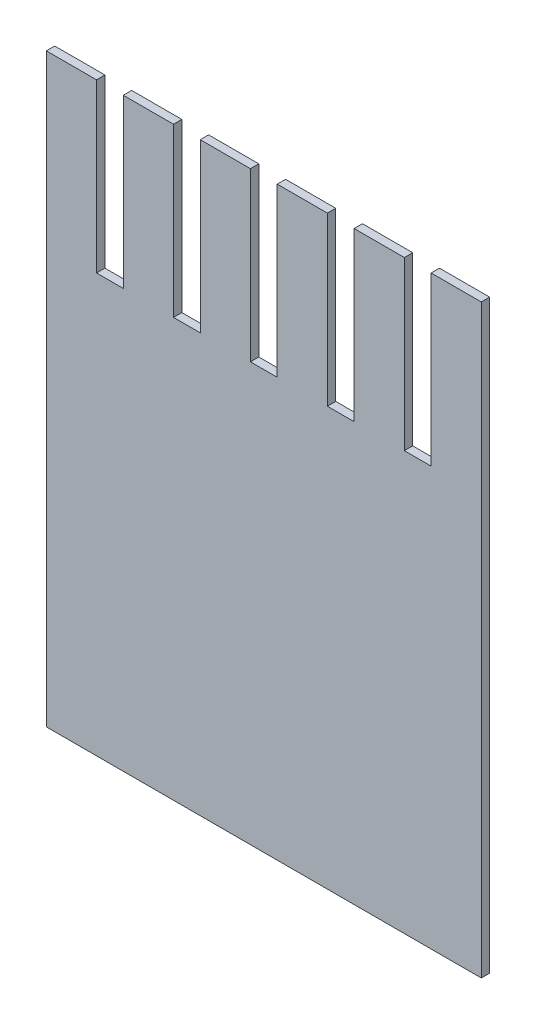
ISO-10303-21;
HEADER;
FILE_DESCRIPTION(('STEP AP214'),'2;1');
FILE_NAME('part.step','',(''),(''),'','','');
FILE_SCHEMA(('AUTOMOTIVE_DESIGN { 1 0 10303 214 1 1 1 1 }'));
ENDSEC;
DATA;
#1=APPLICATION_CONTEXT('core data for automotive mechanical design processes');
#2=APPLICATION_PROTOCOL_DEFINITION('international standard','automotive_design',2000,#1);
#3=PRODUCT_CONTEXT('',#1,'mechanical');
#4=PRODUCT('Part','Part','',(#3));
#5=PRODUCT_RELATED_PRODUCT_CATEGORY('part','',(#4));
#6=PRODUCT_DEFINITION_FORMATION('','',#4);
#7=PRODUCT_DEFINITION_CONTEXT('part definition',#1,'design');
#8=PRODUCT_DEFINITION('design','',#6,#7);
#9=PRODUCT_DEFINITION_SHAPE('','',#8);
#10=(LENGTH_UNIT() NAMED_UNIT(*) SI_UNIT(.MILLI.,.METRE.));
#11=(NAMED_UNIT(*) PLANE_ANGLE_UNIT() SI_UNIT($,.RADIAN.));
#12=(NAMED_UNIT(*) SI_UNIT($,.STERADIAN.) SOLID_ANGLE_UNIT());
#13=UNCERTAINTY_MEASURE_WITH_UNIT(LENGTH_MEASURE(1.E-05),#10,'distance_accuracy_value','');
#14=(GEOMETRIC_REPRESENTATION_CONTEXT(3) GLOBAL_UNCERTAINTY_ASSIGNED_CONTEXT((#13)) GLOBAL_UNIT_ASSIGNED_CONTEXT((#10,
#11,#12)) REPRESENTATION_CONTEXT('',''));
#15=CARTESIAN_POINT('',(0.,0.,0.));
#16=DIRECTION('',(0.,0.,1.));
#17=DIRECTION('',(1.,0.,0.));
#18=AXIS2_PLACEMENT_3D('',#15,#16,#17);
#19=CARTESIAN_POINT('',(0.,0.,0.5));
#20=DIRECTION('',(0.,1.,0.));
#21=DIRECTION('',(0.,0.,1.));
#22=AXIS2_PLACEMENT_3D('',#19,#20,#21);
#23=PLANE('',#22);
#24=DIRECTION('',(1.,0.,0.));
#25=VECTOR('',#24,1.);
#26=CARTESIAN_POINT('',(0.,0.,0.));
#27=LINE('',#26,#25);
#28=CARTESIAN_POINT('',(0.,0.,0.));
#29=VERTEX_POINT('',#28);
#30=CARTESIAN_POINT('',(26.,0.,0.));
#31=VERTEX_POINT('',#30);
#32=EDGE_CURVE('E238',#29,#31,#27,.T.);
#33=ORIENTED_EDGE('',*,*,#32,.T.);
#34=DIRECTION('',(0.,0.,-1.));
#35=VECTOR('',#34,1.);
#36=CARTESIAN_POINT('',(26.,0.,0.5));
#37=LINE('',#36,#35);
#38=CARTESIAN_POINT('',(26.,0.,0.5));
#39=VERTEX_POINT('',#38);
#40=EDGE_CURVE('E11',#39,#31,#37,.T.);
#41=ORIENTED_EDGE('',*,*,#40,.F.);
#42=DIRECTION('',(1.,0.,0.));
#43=VECTOR('',#42,1.);
#44=CARTESIAN_POINT('',(0.,0.,0.5));
#45=LINE('',#44,#43);
#46=CARTESIAN_POINT('',(0.,0.,0.5));
#47=VERTEX_POINT('',#46);
#48=EDGE_CURVE('E318',#47,#39,#45,.T.);
#49=ORIENTED_EDGE('',*,*,#48,.F.);
#50=DIRECTION('',(0.,0.,-1.));
#51=VECTOR('',#50,1.);
#52=CARTESIAN_POINT('',(0.,0.,0.5));
#53=LINE('',#52,#51);
#54=EDGE_CURVE('E58',#47,#29,#53,.T.);
#55=ORIENTED_EDGE('',*,*,#54,.T.);
#56=EDGE_LOOP('',(#33,#41,#49,#55));
#57=FACE_BOUND('',#56,.T.);
#58=ADVANCED_FACE('F41',(#57),#23,.F.);
#59=CARTESIAN_POINT('',(26.,0.,0.5));
#60=DIRECTION('',(-1.,0.,0.));
#61=DIRECTION('',(0.,0.,1.));
#62=AXIS2_PLACEMENT_3D('',#59,#60,#61);
#63=PLANE('',#62);
#64=DIRECTION('',(0.,1.,0.));
#65=VECTOR('',#64,1.);
#66=CARTESIAN_POINT('',(26.,0.,0.));
#67=LINE('',#66,#65);
#68=CARTESIAN_POINT('',(26.,35.,0.));
#69=VERTEX_POINT('',#68);
#70=EDGE_CURVE('E241',#31,#69,#67,.T.);
#71=ORIENTED_EDGE('',*,*,#70,.T.);
#72=DIRECTION('',(0.,0.,-1.));
#73=VECTOR('',#72,1.);
#74=CARTESIAN_POINT('',(26.,35.,0.5));
#75=LINE('',#74,#73);
#76=CARTESIAN_POINT('',(26.,35.,0.5));
#77=VERTEX_POINT('',#76);
#78=EDGE_CURVE('E50',#77,#69,#75,.T.);
#79=ORIENTED_EDGE('',*,*,#78,.F.);
#80=DIRECTION('',(0.,1.,0.));
#81=VECTOR('',#80,1.);
#82=CARTESIAN_POINT('',(26.,0.,0.5));
#83=LINE('',#82,#81);
#84=EDGE_CURVE('E144',#39,#77,#83,.T.);
#85=ORIENTED_EDGE('',*,*,#84,.F.);
#86=ORIENTED_EDGE('',*,*,#40,.T.);
#87=EDGE_LOOP('',(#71,#79,#85,#86));
#88=FACE_BOUND('',#87,.T.);
#89=ADVANCED_FACE('F385',(#88),#63,.F.);
#90=CARTESIAN_POINT('',(0.,35.,0.5));
#91=DIRECTION('',(0.,1.,0.));
#92=DIRECTION('',(0.,0.,1.));
#93=AXIS2_PLACEMENT_3D('',#90,#91,#92);
#94=PLANE('',#93);
#95=DIRECTION('',(1.,0.,0.));
#96=VECTOR('',#95,1.);
#97=CARTESIAN_POINT('',(0.,35.,0.));
#98=LINE('',#97,#96);
#99=CARTESIAN_POINT('',(23.,35.,0.));
#100=VERTEX_POINT('',#99);
#101=EDGE_CURVE('E245',#100,#69,#98,.T.);
#102=ORIENTED_EDGE('',*,*,#101,.F.);
#103=DIRECTION('',(0.,0.,-1.));
#104=VECTOR('',#103,1.);
#105=CARTESIAN_POINT('',(23.,35.,0.5));
#106=LINE('',#105,#104);
#107=CARTESIAN_POINT('',(23.,35.,0.5));
#108=VERTEX_POINT('',#107);
#109=EDGE_CURVE('E376',#108,#100,#106,.T.);
#110=ORIENTED_EDGE('',*,*,#109,.F.);
#111=DIRECTION('',(1.,0.,0.));
#112=VECTOR('',#111,1.);
#113=CARTESIAN_POINT('',(0.,35.,0.5));
#114=LINE('',#113,#112);
#115=EDGE_CURVE('E384',#108,#77,#114,.T.);
#116=ORIENTED_EDGE('',*,*,#115,.T.);
#117=ORIENTED_EDGE('',*,*,#78,.T.);
#118=EDGE_LOOP('',(#102,#110,#116,#117));
#119=FACE_BOUND('',#118,.T.);
#120=ADVANCED_FACE('F382',(#119),#94,.T.);
#121=CARTESIAN_POINT('',(23.,0.,0.5));
#122=DIRECTION('',(1.,0.,0.));
#123=DIRECTION('',(0.,0.,-1.));
#124=AXIS2_PLACEMENT_3D('',#121,#122,#123);
#125=PLANE('',#124);
#126=DIRECTION('',(0.,-1.,0.));
#127=VECTOR('',#126,1.);
#128=CARTESIAN_POINT('',(23.,0.,0.));
#129=LINE('',#128,#127);
#130=CARTESIAN_POINT('',(23.,25.,0.));
#131=VERTEX_POINT('',#130);
#132=EDGE_CURVE('E249',#100,#131,#129,.T.);
#133=ORIENTED_EDGE('',*,*,#132,.T.);
#134=DIRECTION('',(0.,0.,-1.));
#135=VECTOR('',#134,1.);
#136=CARTESIAN_POINT('',(23.,25.,0.5));
#137=LINE('',#136,#135);
#138=CARTESIAN_POINT('',(23.,25.,0.5));
#139=VERTEX_POINT('',#138);
#140=EDGE_CURVE('E373',#139,#131,#137,.T.);
#141=ORIENTED_EDGE('',*,*,#140,.F.);
#142=DIRECTION('',(0.,-1.,0.));
#143=VECTOR('',#142,1.);
#144=CARTESIAN_POINT('',(23.,0.,0.5));
#145=LINE('',#144,#143);
#146=EDGE_CURVE('E396',#108,#139,#145,.T.);
#147=ORIENTED_EDGE('',*,*,#146,.F.);
#148=ORIENTED_EDGE('',*,*,#109,.T.);
#149=EDGE_LOOP('',(#133,#141,#147,#148));
#150=FACE_BOUND('',#149,.T.);
#151=ADVANCED_FACE('F393',(#150),#125,.F.);
#152=CARTESIAN_POINT('',(0.,25.,0.5));
#153=DIRECTION('',(0.,1.,0.));
#154=DIRECTION('',(0.,0.,1.));
#155=AXIS2_PLACEMENT_3D('',#152,#153,#154);
#156=PLANE('',#155);
#157=DIRECTION('',(1.,0.,0.));
#158=VECTOR('',#157,1.);
#159=CARTESIAN_POINT('',(0.,25.,0.));
#160=LINE('',#159,#158);
#161=CARTESIAN_POINT('',(21.4,25.,0.));
#162=VERTEX_POINT('',#161);
#163=EDGE_CURVE('E253',#162,#131,#160,.T.);
#164=ORIENTED_EDGE('',*,*,#163,.F.);
#165=DIRECTION('',(0.,0.,-1.));
#166=VECTOR('',#165,1.);
#167=CARTESIAN_POINT('',(21.4,25.,0.5));
#168=LINE('',#167,#166);
#169=CARTESIAN_POINT('',(21.4,25.,0.5));
#170=VERTEX_POINT('',#169);
#171=EDGE_CURVE('E370',#170,#162,#168,.T.);
#172=ORIENTED_EDGE('',*,*,#171,.F.);
#173=DIRECTION('',(1.,0.,0.));
#174=VECTOR('',#173,1.);
#175=CARTESIAN_POINT('',(0.,25.,0.5));
#176=LINE('',#175,#174);
#177=EDGE_CURVE('E399',#170,#139,#176,.T.);
#178=ORIENTED_EDGE('',*,*,#177,.T.);
#179=ORIENTED_EDGE('',*,*,#140,.T.);
#180=EDGE_LOOP('',(#164,#172,#178,#179));
#181=FACE_BOUND('',#180,.T.);
#182=ADVANCED_FACE('F550',(#181),#156,.T.);
#183=CARTESIAN_POINT('',(21.4,0.,0.5));
#184=DIRECTION('',(1.,0.,0.));
#185=DIRECTION('',(0.,1.,0.));
#186=AXIS2_PLACEMENT_3D('',#183,#184,#185);
#187=PLANE('',#186);
#188=DIRECTION('',(0.,-1.,0.));
#189=VECTOR('',#188,1.);
#190=CARTESIAN_POINT('',(21.4,0.,0.));
#191=LINE('',#190,#189);
#192=CARTESIAN_POINT('',(21.4,35.,0.));
#193=VERTEX_POINT('',#192);
#194=EDGE_CURVE('E257',#193,#162,#191,.T.);
#195=ORIENTED_EDGE('',*,*,#194,.F.);
#196=DIRECTION('',(0.,0.,-1.));
#197=VECTOR('',#196,1.);
#198=CARTESIAN_POINT('',(21.4,35.,0.5));
#199=LINE('',#198,#197);
#200=CARTESIAN_POINT('',(21.4,35.,0.5));
#201=VERTEX_POINT('',#200);
#202=EDGE_CURVE('E367',#201,#193,#199,.T.);
#203=ORIENTED_EDGE('',*,*,#202,.F.);
#204=DIRECTION('',(0.,-1.,0.));
#205=VECTOR('',#204,1.);
#206=CARTESIAN_POINT('',(21.4,0.,0.5));
#207=LINE('',#206,#205);
#208=EDGE_CURVE('E409',#201,#170,#207,.T.);
#209=ORIENTED_EDGE('',*,*,#208,.T.);
#210=ORIENTED_EDGE('',*,*,#171,.T.);
#211=EDGE_LOOP('',(#195,#203,#209,#210));
#212=FACE_BOUND('',#211,.T.);
#213=ADVANCED_FACE('F548',(#212),#187,.T.);
#214=CARTESIAN_POINT('',(0.,35.,0.5));
#215=DIRECTION('',(0.,1.,0.));
#216=DIRECTION('',(0.,0.,1.));
#217=AXIS2_PLACEMENT_3D('',#214,#215,#216);
#218=PLANE('',#217);
#219=DIRECTION('',(1.,0.,0.));
#220=VECTOR('',#219,1.);
#221=CARTESIAN_POINT('',(0.,35.,0.));
#222=LINE('',#221,#220);
#223=CARTESIAN_POINT('',(18.4,35.,0.));
#224=VERTEX_POINT('',#223);
#225=EDGE_CURVE('E263',#224,#193,#222,.T.);
#226=ORIENTED_EDGE('',*,*,#225,.F.);
#227=DIRECTION('',(0.,0.,-1.));
#228=VECTOR('',#227,1.);
#229=CARTESIAN_POINT('',(18.4,35.,0.5));
#230=LINE('',#229,#228);
#231=CARTESIAN_POINT('',(18.4,35.,0.5));
#232=VERTEX_POINT('',#231);
#233=EDGE_CURVE('E364',#232,#224,#230,.T.);
#234=ORIENTED_EDGE('',*,*,#233,.F.);
#235=DIRECTION('',(1.,0.,0.));
#236=VECTOR('',#235,1.);
#237=CARTESIAN_POINT('',(0.,35.,0.5));
#238=LINE('',#237,#236);
#239=EDGE_CURVE('E414',#232,#201,#238,.T.);
#240=ORIENTED_EDGE('',*,*,#239,.T.);
#241=ORIENTED_EDGE('',*,*,#202,.T.);
#242=EDGE_LOOP('',(#226,#234,#240,#241));
#243=FACE_BOUND('',#242,.T.);
#244=ADVANCED_FACE('F544',(#243),#218,.T.);
#245=CARTESIAN_POINT('',(18.4,0.,0.5));
#246=DIRECTION('',(1.,0.,0.));
#247=DIRECTION('',(0.,0.,-1.));
#248=AXIS2_PLACEMENT_3D('',#245,#246,#247);
#249=PLANE('',#248);
#250=DIRECTION('',(0.,-1.,0.));
#251=VECTOR('',#250,1.);
#252=CARTESIAN_POINT('',(18.4,0.,0.));
#253=LINE('',#252,#251);
#254=CARTESIAN_POINT('',(18.4,25.,0.));
#255=VERTEX_POINT('',#254);
#256=EDGE_CURVE('E267',#224,#255,#253,.T.);
#257=ORIENTED_EDGE('',*,*,#256,.T.);
#258=DIRECTION('',(0.,0.,-1.));
#259=VECTOR('',#258,1.);
#260=CARTESIAN_POINT('',(18.4,25.,0.5));
#261=LINE('',#260,#259);
#262=CARTESIAN_POINT('',(18.4,25.,0.5));
#263=VERTEX_POINT('',#262);
#264=EDGE_CURVE('E361',#263,#255,#261,.T.);
#265=ORIENTED_EDGE('',*,*,#264,.F.);
#266=DIRECTION('',(0.,-1.,0.));
#267=VECTOR('',#266,1.);
#268=CARTESIAN_POINT('',(18.4,0.,0.5));
#269=LINE('',#268,#267);
#270=EDGE_CURVE('E418',#232,#263,#269,.T.);
#271=ORIENTED_EDGE('',*,*,#270,.F.);
#272=ORIENTED_EDGE('',*,*,#233,.T.);
#273=EDGE_LOOP('',(#257,#265,#271,#272));
#274=FACE_BOUND('',#273,.T.);
#275=ADVANCED_FACE('F562',(#274),#249,.F.);
#276=CARTESIAN_POINT('',(16.8,25.,0.));
#277=VERTEX_POINT('',#276);
#278=EDGE_CURVE('E259',#277,#255,#160,.T.);
#279=ORIENTED_EDGE('',*,*,#278,.F.);
#280=DIRECTION('',(0.,0.,-1.));
#281=VECTOR('',#280,1.);
#282=CARTESIAN_POINT('',(16.8,25.,0.5));
#283=LINE('',#282,#281);
#284=CARTESIAN_POINT('',(16.8,25.,0.5));
#285=VERTEX_POINT('',#284);
#286=EDGE_CURVE('E358',#285,#277,#283,.T.);
#287=ORIENTED_EDGE('',*,*,#286,.F.);
#288=EDGE_CURVE('E410',#285,#263,#176,.T.);
#289=ORIENTED_EDGE('',*,*,#288,.T.);
#290=ORIENTED_EDGE('',*,*,#264,.T.);
#291=EDGE_LOOP('',(#279,#287,#289,#290));
#292=FACE_BOUND('',#291,.T.);
#293=ADVANCED_FACE('F472',(#292),#156,.T.);
#294=CARTESIAN_POINT('',(16.8,0.,0.5));
#295=DIRECTION('',(1.,0.,0.));
#296=DIRECTION('',(0.,1.,0.));
#297=AXIS2_PLACEMENT_3D('',#294,#295,#296);
#298=PLANE('',#297);
#299=DIRECTION('',(0.,-1.,0.));
#300=VECTOR('',#299,1.);
#301=CARTESIAN_POINT('',(16.8,0.,0.));
#302=LINE('',#301,#300);
#303=CARTESIAN_POINT('',(16.8,35.,0.));
#304=VERTEX_POINT('',#303);
#305=EDGE_CURVE('E271',#304,#277,#302,.T.);
#306=ORIENTED_EDGE('',*,*,#305,.F.);
#307=DIRECTION('',(0.,0.,-1.));
#308=VECTOR('',#307,1.);
#309=CARTESIAN_POINT('',(16.8,35.,0.5));
#310=LINE('',#309,#308);
#311=CARTESIAN_POINT('',(16.8,35.,0.5));
#312=VERTEX_POINT('',#311);
#313=EDGE_CURVE('E355',#312,#304,#310,.T.);
#314=ORIENTED_EDGE('',*,*,#313,.F.);
#315=DIRECTION('',(0.,-1.,0.));
#316=VECTOR('',#315,1.);
#317=CARTESIAN_POINT('',(16.8,0.,0.5));
#318=LINE('',#317,#316);
#319=EDGE_CURVE('E421',#312,#285,#318,.T.);
#320=ORIENTED_EDGE('',*,*,#319,.T.);
#321=ORIENTED_EDGE('',*,*,#286,.T.);
#322=EDGE_LOOP('',(#306,#314,#320,#321));
#323=FACE_BOUND('',#322,.T.);
#324=ADVANCED_FACE('F480',(#323),#298,.T.);
#325=CARTESIAN_POINT('',(0.,35.,0.5));
#326=DIRECTION('',(0.,1.,0.));
#327=DIRECTION('',(0.,0.,1.));
#328=AXIS2_PLACEMENT_3D('',#325,#326,#327);
#329=PLANE('',#328);
#330=DIRECTION('',(1.,0.,0.));
#331=VECTOR('',#330,1.);
#332=CARTESIAN_POINT('',(0.,35.,0.));
#333=LINE('',#332,#331);
#334=CARTESIAN_POINT('',(13.8,35.,0.));
#335=VERTEX_POINT('',#334);
#336=EDGE_CURVE('E275',#335,#304,#333,.T.);
#337=ORIENTED_EDGE('',*,*,#336,.F.);
#338=DIRECTION('',(0.,0.,-1.));
#339=VECTOR('',#338,1.);
#340=CARTESIAN_POINT('',(13.8,35.,0.5));
#341=LINE('',#340,#339);
#342=CARTESIAN_POINT('',(13.8,35.,0.5));
#343=VERTEX_POINT('',#342);
#344=EDGE_CURVE('E352',#343,#335,#341,.T.);
#345=ORIENTED_EDGE('',*,*,#344,.F.);
#346=DIRECTION('',(1.,0.,0.));
#347=VECTOR('',#346,1.);
#348=CARTESIAN_POINT('',(0.,35.,0.5));
#349=LINE('',#348,#347);
#350=EDGE_CURVE('E425',#343,#312,#349,.T.);
#351=ORIENTED_EDGE('',*,*,#350,.T.);
#352=ORIENTED_EDGE('',*,*,#313,.T.);
#353=EDGE_LOOP('',(#337,#345,#351,#352));
#354=FACE_BOUND('',#353,.T.);
#355=ADVANCED_FACE('F483',(#354),#329,.T.);
#356=CARTESIAN_POINT('',(13.8,0.,0.5));
#357=DIRECTION('',(1.,0.,0.));
#358=DIRECTION('',(0.,0.,-1.));
#359=AXIS2_PLACEMENT_3D('',#356,#357,#358);
#360=PLANE('',#359);
#361=DIRECTION('',(0.,-1.,0.));
#362=VECTOR('',#361,1.);
#363=CARTESIAN_POINT('',(13.8,0.,0.));
#364=LINE('',#363,#362);
#365=CARTESIAN_POINT('',(13.8,25.,0.));
#366=VERTEX_POINT('',#365);
#367=EDGE_CURVE('E279',#335,#366,#364,.T.);
#368=ORIENTED_EDGE('',*,*,#367,.T.);
#369=DIRECTION('',(0.,0.,-1.));
#370=VECTOR('',#369,1.);
#371=CARTESIAN_POINT('',(13.8,25.,0.5));
#372=LINE('',#371,#370);
#373=CARTESIAN_POINT('',(13.8,25.,0.5));
#374=VERTEX_POINT('',#373);
#375=EDGE_CURVE('E349',#374,#366,#372,.T.);
#376=ORIENTED_EDGE('',*,*,#375,.F.);
#377=DIRECTION('',(0.,-1.,0.));
#378=VECTOR('',#377,1.);
#379=CARTESIAN_POINT('',(13.8,0.,0.5));
#380=LINE('',#379,#378);
#381=EDGE_CURVE('E429',#343,#374,#380,.T.);
#382=ORIENTED_EDGE('',*,*,#381,.F.);
#383=ORIENTED_EDGE('',*,*,#344,.T.);
#384=EDGE_LOOP('',(#368,#376,#382,#383));
#385=FACE_BOUND('',#384,.T.);
#386=ADVANCED_FACE('F488',(#385),#360,.F.);
#387=CARTESIAN_POINT('',(12.2,25.,0.));
#388=VERTEX_POINT('',#387);
#389=EDGE_CURVE('E283',#388,#366,#160,.T.);
#390=ORIENTED_EDGE('',*,*,#389,.F.);
#391=DIRECTION('',(0.,0.,-1.));
#392=VECTOR('',#391,1.);
#393=CARTESIAN_POINT('',(12.2,25.,0.5));
#394=LINE('',#393,#392);
#395=CARTESIAN_POINT('',(12.2,25.,0.5));
#396=VERTEX_POINT('',#395);
#397=EDGE_CURVE('E346',#396,#388,#394,.T.);
#398=ORIENTED_EDGE('',*,*,#397,.F.);
#399=EDGE_CURVE('E432',#396,#374,#176,.T.);
#400=ORIENTED_EDGE('',*,*,#399,.T.);
#401=ORIENTED_EDGE('',*,*,#375,.T.);
#402=EDGE_LOOP('',(#390,#398,#400,#401));
#403=FACE_BOUND('',#402,.T.);
#404=ADVANCED_FACE('F492',(#403),#156,.T.);
#405=CARTESIAN_POINT('',(12.2,0.,0.5));
#406=DIRECTION('',(1.,0.,0.));
#407=DIRECTION('',(0.,1.,0.));
#408=AXIS2_PLACEMENT_3D('',#405,#406,#407);
#409=PLANE('',#408);
#410=DIRECTION('',(0.,-1.,0.));
#411=VECTOR('',#410,1.);
#412=CARTESIAN_POINT('',(12.2,0.,0.));
#413=LINE('',#412,#411);
#414=CARTESIAN_POINT('',(12.2,35.,0.));
#415=VERTEX_POINT('',#414);
#416=EDGE_CURVE('E284',#415,#388,#413,.T.);
#417=ORIENTED_EDGE('',*,*,#416,.F.);
#418=DIRECTION('',(0.,0.,-1.));
#419=VECTOR('',#418,1.);
#420=CARTESIAN_POINT('',(12.2,35.,0.5));
#421=LINE('',#420,#419);
#422=CARTESIAN_POINT('',(12.2,35.,0.5));
#423=VERTEX_POINT('',#422);
#424=EDGE_CURVE('E343',#423,#415,#421,.T.);
#425=ORIENTED_EDGE('',*,*,#424,.F.);
#426=DIRECTION('',(0.,-1.,0.));
#427=VECTOR('',#426,1.);
#428=CARTESIAN_POINT('',(12.2,0.,0.5));
#429=LINE('',#428,#427);
#430=EDGE_CURVE('E433',#423,#396,#429,.T.);
#431=ORIENTED_EDGE('',*,*,#430,.T.);
#432=ORIENTED_EDGE('',*,*,#397,.T.);
#433=EDGE_LOOP('',(#417,#425,#431,#432));
#434=FACE_BOUND('',#433,.T.);
#435=ADVANCED_FACE('F498',(#434),#409,.T.);
#436=CARTESIAN_POINT('',(0.,35.,0.5));
#437=DIRECTION('',(0.,1.,0.));
#438=DIRECTION('',(0.,0.,1.));
#439=AXIS2_PLACEMENT_3D('',#436,#437,#438);
#440=PLANE('',#439);
#441=DIRECTION('',(1.,0.,0.));
#442=VECTOR('',#441,1.);
#443=CARTESIAN_POINT('',(0.,35.,0.));
#444=LINE('',#443,#442);
#445=CARTESIAN_POINT('',(9.2,35.,0.));
#446=VERTEX_POINT('',#445);
#447=EDGE_CURVE('E288',#446,#415,#444,.T.);
#448=ORIENTED_EDGE('',*,*,#447,.F.);
#449=DIRECTION('',(0.,0.,-1.));
#450=VECTOR('',#449,1.);
#451=CARTESIAN_POINT('',(9.2,35.,0.5));
#452=LINE('',#451,#450);
#453=CARTESIAN_POINT('',(9.2,35.,0.5));
#454=VERTEX_POINT('',#453);
#455=EDGE_CURVE('E340',#454,#446,#452,.T.);
#456=ORIENTED_EDGE('',*,*,#455,.F.);
#457=DIRECTION('',(1.,0.,0.));
#458=VECTOR('',#457,1.);
#459=CARTESIAN_POINT('',(0.,35.,0.5));
#460=LINE('',#459,#458);
#461=EDGE_CURVE('E437',#454,#423,#460,.T.);
#462=ORIENTED_EDGE('',*,*,#461,.T.);
#463=ORIENTED_EDGE('',*,*,#424,.T.);
#464=EDGE_LOOP('',(#448,#456,#462,#463));
#465=FACE_BOUND('',#464,.T.);
#466=ADVANCED_FACE('F501',(#465),#440,.T.);
#467=CARTESIAN_POINT('',(9.2,0.,0.5));
#468=DIRECTION('',(1.,0.,0.));
#469=DIRECTION('',(0.,0.,-1.));
#470=AXIS2_PLACEMENT_3D('',#467,#468,#469);
#471=PLANE('',#470);
#472=DIRECTION('',(0.,-1.,0.));
#473=VECTOR('',#472,1.);
#474=CARTESIAN_POINT('',(9.2,0.,0.));
#475=LINE('',#474,#473);
#476=CARTESIAN_POINT('',(9.2,25.,0.));
#477=VERTEX_POINT('',#476);
#478=EDGE_CURVE('E292',#446,#477,#475,.T.);
#479=ORIENTED_EDGE('',*,*,#478,.T.);
#480=DIRECTION('',(0.,0.,-1.));
#481=VECTOR('',#480,1.);
#482=CARTESIAN_POINT('',(9.2,25.,0.5));
#483=LINE('',#482,#481);
#484=CARTESIAN_POINT('',(9.2,25.,0.5));
#485=VERTEX_POINT('',#484);
#486=EDGE_CURVE('E337',#485,#477,#483,.T.);
#487=ORIENTED_EDGE('',*,*,#486,.F.);
#488=DIRECTION('',(0.,-1.,0.));
#489=VECTOR('',#488,1.);
#490=CARTESIAN_POINT('',(9.2,0.,0.5));
#491=LINE('',#490,#489);
#492=EDGE_CURVE('E441',#454,#485,#491,.T.);
#493=ORIENTED_EDGE('',*,*,#492,.F.);
#494=ORIENTED_EDGE('',*,*,#455,.T.);
#495=EDGE_LOOP('',(#479,#487,#493,#494));
#496=FACE_BOUND('',#495,.T.);
#497=ADVANCED_FACE('F505',(#496),#471,.F.);
#498=CARTESIAN_POINT('',(7.6,25.,0.));
#499=VERTEX_POINT('',#498);
#500=EDGE_CURVE('E296',#499,#477,#160,.T.);
#501=ORIENTED_EDGE('',*,*,#500,.F.);
#502=DIRECTION('',(0.,0.,-1.));
#503=VECTOR('',#502,1.);
#504=CARTESIAN_POINT('',(7.6,25.,0.5));
#505=LINE('',#504,#503);
#506=CARTESIAN_POINT('',(7.6,25.,0.5));
#507=VERTEX_POINT('',#506);
#508=EDGE_CURVE('E334',#507,#499,#505,.T.);
#509=ORIENTED_EDGE('',*,*,#508,.F.);
#510=EDGE_CURVE('E444',#507,#485,#176,.T.);
#511=ORIENTED_EDGE('',*,*,#510,.T.);
#512=ORIENTED_EDGE('',*,*,#486,.T.);
#513=EDGE_LOOP('',(#501,#509,#511,#512));
#514=FACE_BOUND('',#513,.T.);
#515=ADVANCED_FACE('F564',(#514),#156,.T.);
#516=CARTESIAN_POINT('',(7.6,0.,0.5));
#517=DIRECTION('',(1.,0.,0.));
#518=DIRECTION('',(0.,1.,0.));
#519=AXIS2_PLACEMENT_3D('',#516,#517,#518);
#520=PLANE('',#519);
#521=DIRECTION('',(0.,-1.,0.));
#522=VECTOR('',#521,1.);
#523=CARTESIAN_POINT('',(7.6,0.,0.));
#524=LINE('',#523,#522);
#525=CARTESIAN_POINT('',(7.6,35.,0.));
#526=VERTEX_POINT('',#525);
#527=EDGE_CURVE('E297',#526,#499,#524,.T.);
#528=ORIENTED_EDGE('',*,*,#527,.F.);
#529=DIRECTION('',(0.,0.,-1.));
#530=VECTOR('',#529,1.);
#531=CARTESIAN_POINT('',(7.6,35.,0.5));
#532=LINE('',#531,#530);
#533=CARTESIAN_POINT('',(7.6,35.,0.5));
#534=VERTEX_POINT('',#533);
#535=EDGE_CURVE('E331',#534,#526,#532,.T.);
#536=ORIENTED_EDGE('',*,*,#535,.F.);
#537=DIRECTION('',(0.,-1.,0.));
#538=VECTOR('',#537,1.);
#539=CARTESIAN_POINT('',(7.6,0.,0.5));
#540=LINE('',#539,#538);
#541=EDGE_CURVE('E445',#534,#507,#540,.T.);
#542=ORIENTED_EDGE('',*,*,#541,.T.);
#543=ORIENTED_EDGE('',*,*,#508,.T.);
#544=EDGE_LOOP('',(#528,#536,#542,#543));
#545=FACE_BOUND('',#544,.T.);
#546=ADVANCED_FACE('F509',(#545),#520,.T.);
#547=CARTESIAN_POINT('',(0.,35.,0.5));
#548=DIRECTION('',(0.,1.,0.));
#549=DIRECTION('',(0.,0.,1.));
#550=AXIS2_PLACEMENT_3D('',#547,#548,#549);
#551=PLANE('',#550);
#552=DIRECTION('',(1.,0.,0.));
#553=VECTOR('',#552,1.);
#554=CARTESIAN_POINT('',(0.,35.,0.));
#555=LINE('',#554,#553);
#556=CARTESIAN_POINT('',(4.6,35.,0.));
#557=VERTEX_POINT('',#556);
#558=EDGE_CURVE('E301',#557,#526,#555,.T.);
#559=ORIENTED_EDGE('',*,*,#558,.F.);
#560=DIRECTION('',(0.,0.,-1.));
#561=VECTOR('',#560,1.);
#562=CARTESIAN_POINT('',(4.6,35.,0.5));
#563=LINE('',#562,#561);
#564=CARTESIAN_POINT('',(4.6,35.,0.5));
#565=VERTEX_POINT('',#564);
#566=EDGE_CURVE('E328',#565,#557,#563,.T.);
#567=ORIENTED_EDGE('',*,*,#566,.F.);
#568=DIRECTION('',(1.,0.,0.));
#569=VECTOR('',#568,1.);
#570=CARTESIAN_POINT('',(0.,35.,0.5));
#571=LINE('',#570,#569);
#572=EDGE_CURVE('E449',#565,#534,#571,.T.);
#573=ORIENTED_EDGE('',*,*,#572,.T.);
#574=ORIENTED_EDGE('',*,*,#535,.T.);
#575=EDGE_LOOP('',(#559,#567,#573,#574));
#576=FACE_BOUND('',#575,.T.);
#577=ADVANCED_FACE('F513',(#576),#551,.T.);
#578=CARTESIAN_POINT('',(4.6,0.,0.5));
#579=DIRECTION('',(1.,0.,0.));
#580=DIRECTION('',(0.,0.,-1.));
#581=AXIS2_PLACEMENT_3D('',#578,#579,#580);
#582=PLANE('',#581);
#583=DIRECTION('',(0.,-1.,0.));
#584=VECTOR('',#583,1.);
#585=CARTESIAN_POINT('',(4.6,0.,0.));
#586=LINE('',#585,#584);
#587=CARTESIAN_POINT('',(4.6,25.,0.));
#588=VERTEX_POINT('',#587);
#589=EDGE_CURVE('E305',#557,#588,#586,.T.);
#590=ORIENTED_EDGE('',*,*,#589,.T.);
#591=DIRECTION('',(0.,0.,-1.));
#592=VECTOR('',#591,1.);
#593=CARTESIAN_POINT('',(4.6,25.,0.5));
#594=LINE('',#593,#592);
#595=CARTESIAN_POINT('',(4.6,25.,0.5));
#596=VERTEX_POINT('',#595);
#597=EDGE_CURVE('E325',#596,#588,#594,.T.);
#598=ORIENTED_EDGE('',*,*,#597,.F.);
#599=DIRECTION('',(0.,-1.,0.));
#600=VECTOR('',#599,1.);
#601=CARTESIAN_POINT('',(4.6,0.,0.5));
#602=LINE('',#601,#600);
#603=EDGE_CURVE('E452',#565,#596,#602,.T.);
#604=ORIENTED_EDGE('',*,*,#603,.F.);
#605=ORIENTED_EDGE('',*,*,#566,.T.);
#606=EDGE_LOOP('',(#590,#598,#604,#605));
#607=FACE_BOUND('',#606,.T.);
#608=ADVANCED_FACE('F516',(#607),#582,.F.);
#609=CARTESIAN_POINT('',(3.,25.,0.));
#610=VERTEX_POINT('',#609);
#611=EDGE_CURVE('E258',#610,#588,#160,.T.);
#612=ORIENTED_EDGE('',*,*,#611,.F.);
#613=DIRECTION('',(0.,0.,-1.));
#614=VECTOR('',#613,1.);
#615=CARTESIAN_POINT('',(3.,25.,0.5));
#616=LINE('',#615,#614);
#617=CARTESIAN_POINT('',(3.,25.,0.5));
#618=VERTEX_POINT('',#617);
#619=EDGE_CURVE('E218',#618,#610,#616,.T.);
#620=ORIENTED_EDGE('',*,*,#619,.F.);
#621=EDGE_CURVE('E227',#618,#596,#176,.T.);
#622=ORIENTED_EDGE('',*,*,#621,.T.);
#623=ORIENTED_EDGE('',*,*,#597,.T.);
#624=EDGE_LOOP('',(#612,#620,#622,#623));
#625=FACE_BOUND('',#624,.T.);
#626=ADVANCED_FACE('F519',(#625),#156,.T.);
#627=CARTESIAN_POINT('',(3.,0.,0.5));
#628=DIRECTION('',(1.,0.,0.));
#629=DIRECTION('',(0.,1.,0.));
#630=AXIS2_PLACEMENT_3D('',#627,#628,#629);
#631=PLANE('',#630);
#632=DIRECTION('',(0.,-1.,0.));
#633=VECTOR('',#632,1.);
#634=CARTESIAN_POINT('',(3.,0.,0.));
#635=LINE('',#634,#633);
#636=CARTESIAN_POINT('',(3.,35.,0.));
#637=VERTEX_POINT('',#636);
#638=EDGE_CURVE('E213',#637,#610,#635,.T.);
#639=ORIENTED_EDGE('',*,*,#638,.F.);
#640=DIRECTION('',(0.,0.,-1.));
#641=VECTOR('',#640,1.);
#642=CARTESIAN_POINT('',(3.,35.,0.5));
#643=LINE('',#642,#641);
#644=CARTESIAN_POINT('',(3.,35.,0.5));
#645=VERTEX_POINT('',#644);
#646=EDGE_CURVE('E208',#645,#637,#643,.T.);
#647=ORIENTED_EDGE('',*,*,#646,.F.);
#648=DIRECTION('',(0.,-1.,0.));
#649=VECTOR('',#648,1.);
#650=CARTESIAN_POINT('',(3.,0.,0.5));
#651=LINE('',#650,#649);
#652=EDGE_CURVE('E211',#645,#618,#651,.T.);
#653=ORIENTED_EDGE('',*,*,#652,.T.);
#654=ORIENTED_EDGE('',*,*,#619,.T.);
#655=EDGE_LOOP('',(#639,#647,#653,#654));
#656=FACE_BOUND('',#655,.T.);
#657=ADVANCED_FACE('F210',(#656),#631,.T.);
#658=CARTESIAN_POINT('',(0.,35.,0.5));
#659=DIRECTION('',(0.,1.,0.));
#660=DIRECTION('',(0.,0.,1.));
#661=AXIS2_PLACEMENT_3D('',#658,#659,#660);
#662=PLANE('',#661);
#663=DIRECTION('',(1.,0.,0.));
#664=VECTOR('',#663,1.);
#665=CARTESIAN_POINT('',(0.,35.,0.));
#666=LINE('',#665,#664);
#667=CARTESIAN_POINT('',(0.,35.,0.));
#668=VERTEX_POINT('',#667);
#669=EDGE_CURVE('E311',#668,#637,#666,.T.);
#670=ORIENTED_EDGE('',*,*,#669,.F.);
#671=DIRECTION('',(0.,0.,-1.));
#672=VECTOR('',#671,1.);
#673=CARTESIAN_POINT('',(0.,35.,0.5));
#674=LINE('',#673,#672);
#675=CARTESIAN_POINT('',(0.,35.,0.5));
#676=VERTEX_POINT('',#675);
#677=EDGE_CURVE('E132',#676,#668,#674,.T.);
#678=ORIENTED_EDGE('',*,*,#677,.F.);
#679=DIRECTION('',(1.,0.,0.));
#680=VECTOR('',#679,1.);
#681=CARTESIAN_POINT('',(0.,35.,0.5));
#682=LINE('',#681,#680);
#683=EDGE_CURVE('E225',#676,#645,#682,.T.);
#684=ORIENTED_EDGE('',*,*,#683,.T.);
#685=ORIENTED_EDGE('',*,*,#646,.T.);
#686=EDGE_LOOP('',(#670,#678,#684,#685));
#687=FACE_BOUND('',#686,.T.);
#688=ADVANCED_FACE('F230',(#687),#662,.T.);
#689=CARTESIAN_POINT('',(0.,0.,0.5));
#690=DIRECTION('',(-1.,0.,0.));
#691=DIRECTION('',(0.,0.,1.));
#692=AXIS2_PLACEMENT_3D('',#689,#690,#691);
#693=PLANE('',#692);
#694=DIRECTION('',(0.,1.,0.));
#695=VECTOR('',#694,1.);
#696=CARTESIAN_POINT('',(0.,0.,0.));
#697=LINE('',#696,#695);
#698=EDGE_CURVE('E314',#29,#668,#697,.T.);
#699=ORIENTED_EDGE('',*,*,#698,.F.);
#700=ORIENTED_EDGE('',*,*,#54,.F.);
#701=DIRECTION('',(0.,1.,0.));
#702=VECTOR('',#701,1.);
#703=CARTESIAN_POINT('',(0.,0.,0.5));
#704=LINE('',#703,#702);
#705=EDGE_CURVE('E232',#47,#676,#704,.T.);
#706=ORIENTED_EDGE('',*,*,#705,.T.);
#707=ORIENTED_EDGE('',*,*,#677,.T.);
#708=EDGE_LOOP('',(#699,#700,#706,#707));
#709=FACE_BOUND('',#708,.T.);
#710=ADVANCED_FACE('F521',(#709),#693,.T.);
#711=CARTESIAN_POINT('',(0.,0.,0.5));
#712=DIRECTION('',(0.,0.,1.));
#713=DIRECTION('',(1.,0.,0.));
#714=AXIS2_PLACEMENT_3D('',#711,#712,#713);
#715=PLANE('',#714);
#716=ORIENTED_EDGE('',*,*,#48,.T.);
#717=ORIENTED_EDGE('',*,*,#84,.T.);
#718=ORIENTED_EDGE('',*,*,#115,.F.);
#719=ORIENTED_EDGE('',*,*,#146,.T.);
#720=ORIENTED_EDGE('',*,*,#177,.F.);
#721=ORIENTED_EDGE('',*,*,#208,.F.);
#722=ORIENTED_EDGE('',*,*,#239,.F.);
#723=ORIENTED_EDGE('',*,*,#270,.T.);
#724=ORIENTED_EDGE('',*,*,#288,.F.);
#725=ORIENTED_EDGE('',*,*,#319,.F.);
#726=ORIENTED_EDGE('',*,*,#350,.F.);
#727=ORIENTED_EDGE('',*,*,#381,.T.);
#728=ORIENTED_EDGE('',*,*,#399,.F.);
#729=ORIENTED_EDGE('',*,*,#430,.F.);
#730=ORIENTED_EDGE('',*,*,#461,.F.);
#731=ORIENTED_EDGE('',*,*,#492,.T.);
#732=ORIENTED_EDGE('',*,*,#510,.F.);
#733=ORIENTED_EDGE('',*,*,#541,.F.);
#734=ORIENTED_EDGE('',*,*,#572,.F.);
#735=ORIENTED_EDGE('',*,*,#603,.T.);
#736=ORIENTED_EDGE('',*,*,#621,.F.);
#737=ORIENTED_EDGE('',*,*,#652,.F.);
#738=ORIENTED_EDGE('',*,*,#683,.F.);
#739=ORIENTED_EDGE('',*,*,#705,.F.);
#740=EDGE_LOOP('',(#716,#717,#718,#719,#720,#721,#722,#723,#724,#725,#726,#727,#728,#729,#730,
#731,#732,#733,#734,#735,#736,#737,#738,#739));
#741=FACE_BOUND('',#740,.T.);
#742=ADVANCED_FACE('F223',(#741),#715,.T.);
#743=CARTESIAN_POINT('',(0.,0.,0.));
#744=DIRECTION('',(0.,0.,1.));
#745=DIRECTION('',(1.,0.,0.));
#746=AXIS2_PLACEMENT_3D('',#743,#744,#745);
#747=PLANE('',#746);
#748=ORIENTED_EDGE('',*,*,#32,.F.);
#749=ORIENTED_EDGE('',*,*,#698,.T.);
#750=ORIENTED_EDGE('',*,*,#669,.T.);
#751=ORIENTED_EDGE('',*,*,#638,.T.);
#752=ORIENTED_EDGE('',*,*,#611,.T.);
#753=ORIENTED_EDGE('',*,*,#589,.F.);
#754=ORIENTED_EDGE('',*,*,#558,.T.);
#755=ORIENTED_EDGE('',*,*,#527,.T.);
#756=ORIENTED_EDGE('',*,*,#500,.T.);
#757=ORIENTED_EDGE('',*,*,#478,.F.);
#758=ORIENTED_EDGE('',*,*,#447,.T.);
#759=ORIENTED_EDGE('',*,*,#416,.T.);
#760=ORIENTED_EDGE('',*,*,#389,.T.);
#761=ORIENTED_EDGE('',*,*,#367,.F.);
#762=ORIENTED_EDGE('',*,*,#336,.T.);
#763=ORIENTED_EDGE('',*,*,#305,.T.);
#764=ORIENTED_EDGE('',*,*,#278,.T.);
#765=ORIENTED_EDGE('',*,*,#256,.F.);
#766=ORIENTED_EDGE('',*,*,#225,.T.);
#767=ORIENTED_EDGE('',*,*,#194,.T.);
#768=ORIENTED_EDGE('',*,*,#163,.T.);
#769=ORIENTED_EDGE('',*,*,#132,.F.);
#770=ORIENTED_EDGE('',*,*,#101,.T.);
#771=ORIENTED_EDGE('',*,*,#70,.F.);
#772=EDGE_LOOP('',(#748,#749,#750,#751,#752,#753,#754,#755,#756,#757,#758,#759,#760,#761,#762,
#763,#764,#765,#766,#767,#768,#769,#770,#771));
#773=FACE_BOUND('',#772,.T.);
#774=ADVANCED_FACE('F389',(#773),#747,.F.);
#775=CLOSED_SHELL('',(#58,#89,#120,#151,#182,#213,#244,#275,#293,#324,#355,#386,#404,#435,#466,
#497,#515,#546,#577,#608,#626,#657,#688,#710,#742,#774));
#776=MANIFOLD_SOLID_BREP('B2',#775);
#777=ADVANCED_BREP_SHAPE_REPRESENTATION('',(#18,#776),#14);
#778=SHAPE_DEFINITION_REPRESENTATION(#9,#777);
ENDSEC;
END-ISO-10303-21;
